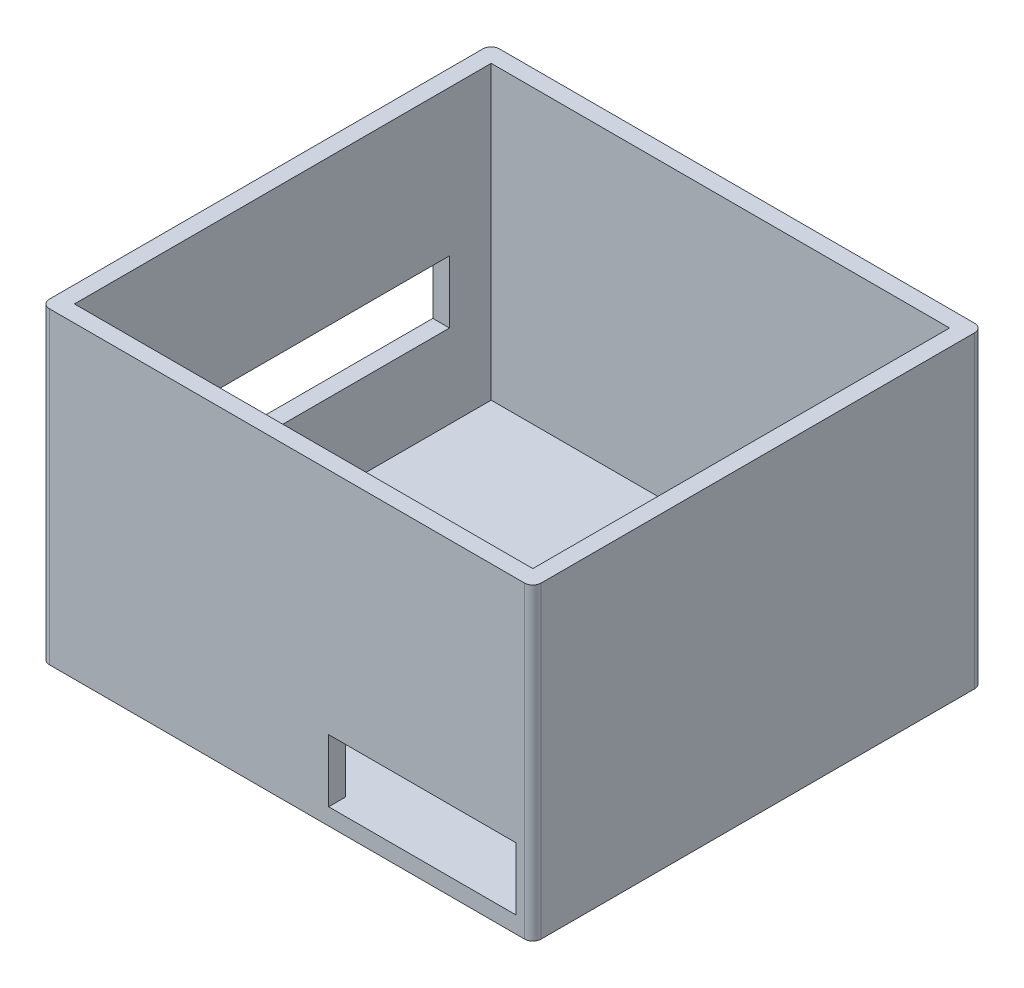
ISO-10303-21;
HEADER;
FILE_DESCRIPTION(('STEP AP214'),'2;1');
FILE_NAME('part.step','',(''),(''),'','','');
FILE_SCHEMA(('AUTOMOTIVE_DESIGN { 1 0 10303 214 1 1 1 1 }'));
ENDSEC;
DATA;
#1=APPLICATION_CONTEXT('core data for automotive mechanical design processes');
#2=APPLICATION_PROTOCOL_DEFINITION('international standard','automotive_design',2000,#1);
#3=PRODUCT_CONTEXT('',#1,'mechanical');
#4=PRODUCT('Part','Part','',(#3));
#5=PRODUCT_RELATED_PRODUCT_CATEGORY('part','',(#4));
#6=PRODUCT_DEFINITION_FORMATION('','',#4);
#7=PRODUCT_DEFINITION_CONTEXT('part definition',#1,'design');
#8=PRODUCT_DEFINITION('design','',#6,#7);
#9=PRODUCT_DEFINITION_SHAPE('','',#8);
#10=(LENGTH_UNIT() NAMED_UNIT(*) SI_UNIT(.MILLI.,.METRE.));
#11=(NAMED_UNIT(*) PLANE_ANGLE_UNIT() SI_UNIT($,.RADIAN.));
#12=(NAMED_UNIT(*) SI_UNIT($,.STERADIAN.) SOLID_ANGLE_UNIT());
#13=UNCERTAINTY_MEASURE_WITH_UNIT(LENGTH_MEASURE(1.E-05),#10,'distance_accuracy_value','');
#14=(GEOMETRIC_REPRESENTATION_CONTEXT(3) GLOBAL_UNCERTAINTY_ASSIGNED_CONTEXT((#13)) GLOBAL_UNIT_ASSIGNED_CONTEXT((#10,
#11,#12)) REPRESENTATION_CONTEXT('',''));
#15=CARTESIAN_POINT('',(0.,0.,0.));
#16=DIRECTION('',(0.,0.,1.));
#17=DIRECTION('',(1.,0.,0.));
#18=AXIS2_PLACEMENT_3D('',#15,#16,#17);
#19=CARTESIAN_POINT('',(0.,4.,0.));
#20=DIRECTION('',(1.,0.,0.));
#21=DIRECTION('',(0.,0.,-1.));
#22=AXIS2_PLACEMENT_3D('',#19,#20,#21);
#23=PLANE('',#22);
#24=DIRECTION('',(0.,-1.,0.));
#25=VECTOR('',#24,1.);
#26=CARTESIAN_POINT('',(0.,39.,-94.));
#27=LINE('',#26,#25);
#28=CARTESIAN_POINT('',(0.,39.,-94.));
#29=VERTEX_POINT('',#28);
#30=CARTESIAN_POINT('',(0.,24.,-94.));
#31=VERTEX_POINT('',#30);
#32=EDGE_CURVE('E204',#29,#31,#27,.T.);
#33=ORIENTED_EDGE('',*,*,#32,.F.);
#34=DIRECTION('',(0.,0.,-1.));
#35=VECTOR('',#34,1.);
#36=CARTESIAN_POINT('',(0.,39.,-94.));
#37=LINE('',#36,#35);
#38=CARTESIAN_POINT('',(0.,39.,-14.));
#39=VERTEX_POINT('',#38);
#40=EDGE_CURVE('E207',#39,#29,#37,.T.);
#41=ORIENTED_EDGE('',*,*,#40,.F.);
#42=DIRECTION('',(0.,1.,0.));
#43=VECTOR('',#42,1.);
#44=CARTESIAN_POINT('',(0.,39.,-14.));
#45=LINE('',#44,#43);
#46=CARTESIAN_POINT('',(0.,24.,-14.));
#47=VERTEX_POINT('',#46);
#48=EDGE_CURVE('E200',#47,#39,#45,.T.);
#49=ORIENTED_EDGE('',*,*,#48,.F.);
#50=DIRECTION('',(0.,0.,1.));
#51=VECTOR('',#50,1.);
#52=CARTESIAN_POINT('',(0.,24.,-94.));
#53=LINE('',#52,#51);
#54=EDGE_CURVE('E201',#31,#47,#53,.T.);
#55=ORIENTED_EDGE('',*,*,#54,.F.);
#56=EDGE_LOOP('',(#33,#41,#49,#55));
#57=FACE_BOUND('',#56,.T.);
#58=DIRECTION('',(0.,0.,1.));
#59=VECTOR('',#58,1.);
#60=CARTESIAN_POINT('',(0.,74.,-108.));
#61=LINE('',#60,#59);
#62=CARTESIAN_POINT('',(0.,74.,-106.));
#63=VERTEX_POINT('',#62);
#64=CARTESIAN_POINT('',(0.,74.,-2.));
#65=VERTEX_POINT('',#64);
#66=EDGE_CURVE('E259',#63,#65,#61,.T.);
#67=ORIENTED_EDGE('',*,*,#66,.F.);
#68=DIRECTION('',(0.,-1.,0.));
#69=VECTOR('',#68,1.);
#70=CARTESIAN_POINT('',(0.,4.,-106.));
#71=LINE('',#70,#69);
#72=CARTESIAN_POINT('',(0.,0.,-106.));
#73=VERTEX_POINT('',#72);
#74=EDGE_CURVE('E11',#63,#73,#71,.T.);
#75=ORIENTED_EDGE('',*,*,#74,.T.);
#76=DIRECTION('',(0.,0.,1.));
#77=VECTOR('',#76,1.);
#78=CARTESIAN_POINT('',(0.,0.,0.));
#79=LINE('',#78,#77);
#80=CARTESIAN_POINT('',(0.,0.,-2.));
#81=VERTEX_POINT('',#80);
#82=EDGE_CURVE('E269',#73,#81,#79,.T.);
#83=ORIENTED_EDGE('',*,*,#82,.T.);
#84=DIRECTION('',(0.,-1.,0.));
#85=VECTOR('',#84,1.);
#86=CARTESIAN_POINT('',(0.,4.,-2.));
#87=LINE('',#86,#85);
#88=EDGE_CURVE('E40',#81,#65,#87,.F.);
#89=ORIENTED_EDGE('',*,*,#88,.T.);
#90=EDGE_LOOP('',(#67,#75,#83,#89));
#91=FACE_BOUND('',#90,.T.);
#92=ADVANCED_FACE('F32',(#57,#91),#23,.F.);
#93=CARTESIAN_POINT('',(0.,4.,0.));
#94=DIRECTION('',(0.,0.,-1.));
#95=DIRECTION('',(-1.,0.,0.));
#96=AXIS2_PLACEMENT_3D('',#93,#94,#95);
#97=PLANE('',#96);
#98=DIRECTION('',(0.,-1.,0.));
#99=VECTOR('',#98,1.);
#100=CARTESIAN_POINT('',(69.,19.,0.));
#101=LINE('',#100,#99);
#102=CARTESIAN_POINT('',(69.,19.,0.));
#103=VERTEX_POINT('',#102);
#104=CARTESIAN_POINT('',(69.,4.,0.));
#105=VERTEX_POINT('',#104);
#106=EDGE_CURVE('E191',#103,#105,#101,.T.);
#107=ORIENTED_EDGE('',*,*,#106,.F.);
#108=DIRECTION('',(-1.,0.,0.));
#109=VECTOR('',#108,1.);
#110=CARTESIAN_POINT('',(69.,19.,0.));
#111=LINE('',#110,#109);
#112=CARTESIAN_POINT('',(114.,19.,0.));
#113=VERTEX_POINT('',#112);
#114=EDGE_CURVE('E181',#113,#103,#111,.T.);
#115=ORIENTED_EDGE('',*,*,#114,.F.);
#116=DIRECTION('',(0.,1.,0.));
#117=VECTOR('',#116,1.);
#118=CARTESIAN_POINT('',(114.,19.,0.));
#119=LINE('',#118,#117);
#120=CARTESIAN_POINT('',(114.,4.,0.));
#121=VERTEX_POINT('',#120);
#122=EDGE_CURVE('E194',#121,#113,#119,.T.);
#123=ORIENTED_EDGE('',*,*,#122,.F.);
#124=DIRECTION('',(1.,0.,0.));
#125=VECTOR('',#124,1.);
#126=CARTESIAN_POINT('',(69.,4.,0.));
#127=LINE('',#126,#125);
#128=EDGE_CURVE('E188',#105,#121,#127,.T.);
#129=ORIENTED_EDGE('',*,*,#128,.F.);
#130=EDGE_LOOP('',(#107,#115,#123,#129));
#131=FACE_BOUND('',#130,.T.);
#132=DIRECTION('',(1.,0.,0.));
#133=VECTOR('',#132,1.);
#134=CARTESIAN_POINT('',(0.,0.,0.));
#135=LINE('',#134,#133);
#136=CARTESIAN_POINT('',(2.,0.,0.));
#137=VERTEX_POINT('',#136);
#138=CARTESIAN_POINT('',(116.,0.,0.));
#139=VERTEX_POINT('',#138);
#140=EDGE_CURVE('E272',#137,#139,#135,.T.);
#141=ORIENTED_EDGE('',*,*,#140,.T.);
#142=DIRECTION('',(0.,-1.,0.));
#143=VECTOR('',#142,1.);
#144=CARTESIAN_POINT('',(116.,4.,0.));
#145=LINE('',#144,#143);
#146=CARTESIAN_POINT('',(116.,74.,0.));
#147=VERTEX_POINT('',#146);
#148=EDGE_CURVE('E296',#139,#147,#145,.F.);
#149=ORIENTED_EDGE('',*,*,#148,.T.);
#150=DIRECTION('',(1.,0.,0.));
#151=VECTOR('',#150,1.);
#152=CARTESIAN_POINT('',(0.,74.,0.));
#153=LINE('',#152,#151);
#154=CARTESIAN_POINT('',(2.,74.,0.));
#155=VERTEX_POINT('',#154);
#156=EDGE_CURVE('E262',#155,#147,#153,.T.);
#157=ORIENTED_EDGE('',*,*,#156,.F.);
#158=DIRECTION('',(0.,-1.,0.));
#159=VECTOR('',#158,1.);
#160=CARTESIAN_POINT('',(2.,4.,0.));
#161=LINE('',#160,#159);
#162=EDGE_CURVE('E293',#155,#137,#161,.T.);
#163=ORIENTED_EDGE('',*,*,#162,.T.);
#164=EDGE_LOOP('',(#141,#149,#157,#163));
#165=FACE_BOUND('',#164,.T.);
#166=ADVANCED_FACE('F322',(#131,#165),#97,.F.);
#167=CARTESIAN_POINT('',(118.,4.,0.));
#168=DIRECTION('',(-1.,0.,0.));
#169=DIRECTION('',(0.,0.,1.));
#170=AXIS2_PLACEMENT_3D('',#167,#168,#169);
#171=PLANE('',#170);
#172=DIRECTION('',(0.,0.,-1.));
#173=VECTOR('',#172,1.);
#174=CARTESIAN_POINT('',(118.,74.,-108.));
#175=LINE('',#174,#173);
#176=CARTESIAN_POINT('',(118.,74.,-2.));
#177=VERTEX_POINT('',#176);
#178=CARTESIAN_POINT('',(118.,74.,-106.));
#179=VERTEX_POINT('',#178);
#180=EDGE_CURVE('E265',#177,#179,#175,.T.);
#181=ORIENTED_EDGE('',*,*,#180,.F.);
#182=DIRECTION('',(0.,-1.,0.));
#183=VECTOR('',#182,1.);
#184=CARTESIAN_POINT('',(118.,4.,-2.));
#185=LINE('',#184,#183);
#186=CARTESIAN_POINT('',(118.,0.,-2.));
#187=VERTEX_POINT('',#186);
#188=EDGE_CURVE('E282',#177,#187,#185,.T.);
#189=ORIENTED_EDGE('',*,*,#188,.T.);
#190=DIRECTION('',(0.,0.,-1.));
#191=VECTOR('',#190,1.);
#192=CARTESIAN_POINT('',(118.,0.,0.));
#193=LINE('',#192,#191);
#194=CARTESIAN_POINT('',(118.,0.,-106.));
#195=VERTEX_POINT('',#194);
#196=EDGE_CURVE('E275',#187,#195,#193,.T.);
#197=ORIENTED_EDGE('',*,*,#196,.T.);
#198=DIRECTION('',(0.,-1.,0.));
#199=VECTOR('',#198,1.);
#200=CARTESIAN_POINT('',(118.,4.,-106.));
#201=LINE('',#200,#199);
#202=EDGE_CURVE('E280',#195,#179,#201,.F.);
#203=ORIENTED_EDGE('',*,*,#202,.T.);
#204=EDGE_LOOP('',(#181,#189,#197,#203));
#205=FACE_BOUND('',#204,.T.);
#206=ADVANCED_FACE('F333',(#205),#171,.F.);
#207=CARTESIAN_POINT('',(0.,4.,-108.));
#208=DIRECTION('',(0.,0.,1.));
#209=DIRECTION('',(1.,0.,0.));
#210=AXIS2_PLACEMENT_3D('',#207,#208,#209);
#211=PLANE('',#210);
#212=DIRECTION('',(-1.,0.,0.));
#213=VECTOR('',#212,1.);
#214=CARTESIAN_POINT('',(0.,74.,-108.));
#215=LINE('',#214,#213);
#216=CARTESIAN_POINT('',(116.,74.,-108.));
#217=VERTEX_POINT('',#216);
#218=CARTESIAN_POINT('',(2.,74.,-108.));
#219=VERTEX_POINT('',#218);
#220=EDGE_CURVE('E267',#217,#219,#215,.T.);
#221=ORIENTED_EDGE('',*,*,#220,.F.);
#222=DIRECTION('',(0.,-1.,0.));
#223=VECTOR('',#222,1.);
#224=CARTESIAN_POINT('',(116.,4.,-108.));
#225=LINE('',#224,#223);
#226=CARTESIAN_POINT('',(116.,0.,-108.));
#227=VERTEX_POINT('',#226);
#228=EDGE_CURVE('E306',#217,#227,#225,.T.);
#229=ORIENTED_EDGE('',*,*,#228,.T.);
#230=DIRECTION('',(-1.,0.,0.));
#231=VECTOR('',#230,1.);
#232=CARTESIAN_POINT('',(0.,0.,-108.));
#233=LINE('',#232,#231);
#234=CARTESIAN_POINT('',(2.,0.,-108.));
#235=VERTEX_POINT('',#234);
#236=EDGE_CURVE('E278',#227,#235,#233,.T.);
#237=ORIENTED_EDGE('',*,*,#236,.T.);
#238=DIRECTION('',(0.,-1.,0.));
#239=VECTOR('',#238,1.);
#240=CARTESIAN_POINT('',(2.,4.,-108.));
#241=LINE('',#240,#239);
#242=EDGE_CURVE('E47',#235,#219,#241,.F.);
#243=ORIENTED_EDGE('',*,*,#242,.T.);
#244=EDGE_LOOP('',(#221,#229,#237,#243));
#245=FACE_BOUND('',#244,.T.);
#246=ADVANCED_FACE('F339',(#245),#211,.F.);
#247=CARTESIAN_POINT('',(0.,0.,0.));
#248=DIRECTION('',(0.,-1.,0.));
#249=DIRECTION('',(0.,0.,-1.));
#250=AXIS2_PLACEMENT_3D('',#247,#248,#249);
#251=PLANE('',#250);
#252=ORIENTED_EDGE('',*,*,#196,.F.);
#253=CARTESIAN_POINT('',(116.,0.,-2.));
#254=DIRECTION('',(0.,-1.,0.));
#255=DIRECTION('',(0.,0.,-1.));
#256=AXIS2_PLACEMENT_3D('',#253,#254,#255);
#257=CIRCLE('',#256,2.);
#258=EDGE_CURVE('E291',#187,#139,#257,.T.);
#259=ORIENTED_EDGE('',*,*,#258,.T.);
#260=ORIENTED_EDGE('',*,*,#140,.F.);
#261=CARTESIAN_POINT('',(2.,0.,-2.));
#262=DIRECTION('',(0.,-1.,0.));
#263=DIRECTION('',(0.,0.,-1.));
#264=AXIS2_PLACEMENT_3D('',#261,#262,#263);
#265=CIRCLE('',#264,2.);
#266=EDGE_CURVE('E285',#137,#81,#265,.T.);
#267=ORIENTED_EDGE('',*,*,#266,.T.);
#268=ORIENTED_EDGE('',*,*,#82,.F.);
#269=CARTESIAN_POINT('',(2.,0.,-106.));
#270=DIRECTION('',(0.,-1.,0.));
#271=DIRECTION('',(0.,0.,-1.));
#272=AXIS2_PLACEMENT_3D('',#269,#270,#271);
#273=CIRCLE('',#272,2.);
#274=EDGE_CURVE('E287',#73,#235,#273,.T.);
#275=ORIENTED_EDGE('',*,*,#274,.T.);
#276=ORIENTED_EDGE('',*,*,#236,.F.);
#277=CARTESIAN_POINT('',(116.,0.,-106.));
#278=DIRECTION('',(0.,-1.,0.));
#279=DIRECTION('',(0.,0.,-1.));
#280=AXIS2_PLACEMENT_3D('',#277,#278,#279);
#281=CIRCLE('',#280,2.);
#282=EDGE_CURVE('E289',#227,#195,#281,.T.);
#283=ORIENTED_EDGE('',*,*,#282,.T.);
#284=EDGE_LOOP('',(#252,#259,#260,#267,#268,#275,#276,#283));
#285=FACE_BOUND('',#284,.T.);
#286=ADVANCED_FACE('F326',(#285),#251,.T.);
#287=CARTESIAN_POINT('',(0.,74.,0.));
#288=DIRECTION('',(0.,1.,0.));
#289=DIRECTION('',(0.,0.,1.));
#290=AXIS2_PLACEMENT_3D('',#287,#288,#289);
#291=PLANE('',#290);
#292=ORIENTED_EDGE('',*,*,#156,.T.);
#293=CARTESIAN_POINT('',(116.,74.,-2.));
#294=DIRECTION('',(0.,1.,0.));
#295=DIRECTION('',(0.,0.,1.));
#296=AXIS2_PLACEMENT_3D('',#293,#294,#295);
#297=CIRCLE('',#296,2.);
#298=EDGE_CURVE('E303',#147,#177,#297,.T.);
#299=ORIENTED_EDGE('',*,*,#298,.T.);
#300=ORIENTED_EDGE('',*,*,#180,.T.);
#301=CARTESIAN_POINT('',(116.,74.,-106.));
#302=DIRECTION('',(0.,1.,0.));
#303=DIRECTION('',(0.,0.,1.));
#304=AXIS2_PLACEMENT_3D('',#301,#302,#303);
#305=CIRCLE('',#304,2.);
#306=EDGE_CURVE('E54',#179,#217,#305,.T.);
#307=ORIENTED_EDGE('',*,*,#306,.T.);
#308=ORIENTED_EDGE('',*,*,#220,.T.);
#309=CARTESIAN_POINT('',(2.,74.,-106.));
#310=DIRECTION('',(0.,1.,0.));
#311=DIRECTION('',(0.,0.,1.));
#312=AXIS2_PLACEMENT_3D('',#309,#310,#311);
#313=CIRCLE('',#312,2.);
#314=EDGE_CURVE('E300',#219,#63,#313,.T.);
#315=ORIENTED_EDGE('',*,*,#314,.T.);
#316=ORIENTED_EDGE('',*,*,#66,.T.);
#317=CARTESIAN_POINT('',(2.,74.,-2.));
#318=DIRECTION('',(0.,1.,0.));
#319=DIRECTION('',(0.,0.,1.));
#320=AXIS2_PLACEMENT_3D('',#317,#318,#319);
#321=CIRCLE('',#320,2.);
#322=EDGE_CURVE('E298',#65,#155,#321,.T.);
#323=ORIENTED_EDGE('',*,*,#322,.T.);
#324=EDGE_LOOP('',(#292,#299,#300,#307,#308,#315,#316,#323));
#325=FACE_BOUND('',#324,.T.);
#326=DIRECTION('',(0.,0.,1.));
#327=VECTOR('',#326,1.);
#328=CARTESIAN_POINT('',(4.,74.,-104.));
#329=LINE('',#328,#327);
#330=CARTESIAN_POINT('',(4.,74.,-104.));
#331=VERTEX_POINT('',#330);
#332=CARTESIAN_POINT('',(4.,74.,-4.));
#333=VERTEX_POINT('',#332);
#334=EDGE_CURVE('E235',#331,#333,#329,.T.);
#335=ORIENTED_EDGE('',*,*,#334,.F.);
#336=DIRECTION('',(-1.,0.,0.));
#337=VECTOR('',#336,1.);
#338=CARTESIAN_POINT('',(4.,74.,-104.));
#339=LINE('',#338,#337);
#340=CARTESIAN_POINT('',(114.,74.,-104.));
#341=VERTEX_POINT('',#340);
#342=EDGE_CURVE('E233',#341,#331,#339,.T.);
#343=ORIENTED_EDGE('',*,*,#342,.F.);
#344=DIRECTION('',(0.,0.,-1.));
#345=VECTOR('',#344,1.);
#346=CARTESIAN_POINT('',(114.,74.,-104.));
#347=LINE('',#346,#345);
#348=CARTESIAN_POINT('',(114.,74.,-4.));
#349=VERTEX_POINT('',#348);
#350=EDGE_CURVE('E240',#349,#341,#347,.T.);
#351=ORIENTED_EDGE('',*,*,#350,.F.);
#352=DIRECTION('',(1.,0.,0.));
#353=VECTOR('',#352,1.);
#354=CARTESIAN_POINT('',(4.,74.,-4.));
#355=LINE('',#354,#353);
#356=EDGE_CURVE('E238',#333,#349,#355,.T.);
#357=ORIENTED_EDGE('',*,*,#356,.F.);
#358=EDGE_LOOP('',(#335,#343,#351,#357));
#359=FACE_BOUND('',#358,.T.);
#360=ADVANCED_FACE('F315',(#325,#359),#291,.T.);
#361=CARTESIAN_POINT('',(4.,74.,-104.));
#362=DIRECTION('',(0.,0.,1.));
#363=DIRECTION('',(1.,0.,0.));
#364=AXIS2_PLACEMENT_3D('',#361,#362,#363);
#365=PLANE('',#364);
#366=DIRECTION('',(-1.,0.,0.));
#367=VECTOR('',#366,1.);
#368=CARTESIAN_POINT('',(4.,4.,-104.));
#369=LINE('',#368,#367);
#370=CARTESIAN_POINT('',(114.,4.,-104.));
#371=VERTEX_POINT('',#370);
#372=CARTESIAN_POINT('',(4.,4.,-104.));
#373=VERTEX_POINT('',#372);
#374=EDGE_CURVE('E232',#371,#373,#369,.T.);
#375=ORIENTED_EDGE('',*,*,#374,.F.);
#376=DIRECTION('',(0.,-1.,0.));
#377=VECTOR('',#376,1.);
#378=CARTESIAN_POINT('',(114.,74.,-104.));
#379=LINE('',#378,#377);
#380=EDGE_CURVE('E242',#341,#371,#379,.T.);
#381=ORIENTED_EDGE('',*,*,#380,.F.);
#382=ORIENTED_EDGE('',*,*,#342,.T.);
#383=DIRECTION('',(0.,-1.,0.));
#384=VECTOR('',#383,1.);
#385=CARTESIAN_POINT('',(4.,74.,-104.));
#386=LINE('',#385,#384);
#387=EDGE_CURVE('E256',#331,#373,#386,.T.);
#388=ORIENTED_EDGE('',*,*,#387,.T.);
#389=EDGE_LOOP('',(#375,#381,#382,#388));
#390=FACE_BOUND('',#389,.T.);
#391=ADVANCED_FACE('F395',(#390),#365,.T.);
#392=CARTESIAN_POINT('',(4.,74.,-104.));
#393=DIRECTION('',(1.,0.,0.));
#394=DIRECTION('',(0.,0.,-1.));
#395=AXIS2_PLACEMENT_3D('',#392,#393,#394);
#396=PLANE('',#395);
#397=DIRECTION('',(0.,0.,-1.));
#398=VECTOR('',#397,1.);
#399=CARTESIAN_POINT('',(4.,39.,-94.));
#400=LINE('',#399,#398);
#401=CARTESIAN_POINT('',(4.,39.,-14.));
#402=VERTEX_POINT('',#401);
#403=CARTESIAN_POINT('',(4.,39.,-94.));
#404=VERTEX_POINT('',#403);
#405=EDGE_CURVE('E203',#402,#404,#400,.T.);
#406=ORIENTED_EDGE('',*,*,#405,.T.);
#407=DIRECTION('',(0.,-1.,0.));
#408=VECTOR('',#407,1.);
#409=CARTESIAN_POINT('',(4.,39.,-94.));
#410=LINE('',#409,#408);
#411=CARTESIAN_POINT('',(4.,24.,-94.));
#412=VERTEX_POINT('',#411);
#413=EDGE_CURVE('E224',#404,#412,#410,.T.);
#414=ORIENTED_EDGE('',*,*,#413,.T.);
#415=DIRECTION('',(0.,0.,1.));
#416=VECTOR('',#415,1.);
#417=CARTESIAN_POINT('',(4.,24.,-94.));
#418=LINE('',#417,#416);
#419=CARTESIAN_POINT('',(4.,24.,-14.));
#420=VERTEX_POINT('',#419);
#421=EDGE_CURVE('E220',#412,#420,#418,.T.);
#422=ORIENTED_EDGE('',*,*,#421,.T.);
#423=DIRECTION('',(0.,1.,0.));
#424=VECTOR('',#423,1.);
#425=CARTESIAN_POINT('',(4.,39.,-14.));
#426=LINE('',#425,#424);
#427=EDGE_CURVE('E215',#420,#402,#426,.T.);
#428=ORIENTED_EDGE('',*,*,#427,.T.);
#429=EDGE_LOOP('',(#406,#414,#422,#428));
#430=FACE_BOUND('',#429,.T.);
#431=DIRECTION('',(0.,0.,1.));
#432=VECTOR('',#431,1.);
#433=CARTESIAN_POINT('',(4.,4.,-104.));
#434=LINE('',#433,#432);
#435=CARTESIAN_POINT('',(4.,4.,-4.));
#436=VERTEX_POINT('',#435);
#437=EDGE_CURVE('E245',#373,#436,#434,.T.);
#438=ORIENTED_EDGE('',*,*,#437,.F.);
#439=ORIENTED_EDGE('',*,*,#387,.F.);
#440=ORIENTED_EDGE('',*,*,#334,.T.);
#441=DIRECTION('',(0.,-1.,0.));
#442=VECTOR('',#441,1.);
#443=CARTESIAN_POINT('',(4.,74.,-4.));
#444=LINE('',#443,#442);
#445=EDGE_CURVE('E254',#333,#436,#444,.T.);
#446=ORIENTED_EDGE('',*,*,#445,.T.);
#447=EDGE_LOOP('',(#438,#439,#440,#446));
#448=FACE_BOUND('',#447,.T.);
#449=ADVANCED_FACE('F392',(#430,#448),#396,.T.);
#450=CARTESIAN_POINT('',(4.,74.,-4.));
#451=DIRECTION('',(0.,0.,-1.));
#452=DIRECTION('',(-1.,0.,0.));
#453=AXIS2_PLACEMENT_3D('',#450,#451,#452);
#454=PLANE('',#453);
#455=DIRECTION('',(-1.,0.,0.));
#456=VECTOR('',#455,1.);
#457=CARTESIAN_POINT('',(69.,19.,-4.));
#458=LINE('',#457,#456);
#459=CARTESIAN_POINT('',(114.,19.,-4.00000000000001));
#460=VERTEX_POINT('',#459);
#461=CARTESIAN_POINT('',(69.,19.,-4.));
#462=VERTEX_POINT('',#461);
#463=EDGE_CURVE('E178',#460,#462,#458,.T.);
#464=ORIENTED_EDGE('',*,*,#463,.T.);
#465=DIRECTION('',(0.,-1.,0.));
#466=VECTOR('',#465,1.);
#467=CARTESIAN_POINT('',(69.,19.,-4.));
#468=LINE('',#467,#466);
#469=CARTESIAN_POINT('',(69.,4.,-4.));
#470=VERTEX_POINT('',#469);
#471=EDGE_CURVE('E164',#462,#470,#468,.T.);
#472=ORIENTED_EDGE('',*,*,#471,.T.);
#473=DIRECTION('',(1.,0.,0.));
#474=VECTOR('',#473,1.);
#475=CARTESIAN_POINT('',(4.,4.,-4.));
#476=LINE('',#475,#474);
#477=EDGE_CURVE('E248',#436,#470,#476,.T.);
#478=ORIENTED_EDGE('',*,*,#477,.F.);
#479=ORIENTED_EDGE('',*,*,#445,.F.);
#480=ORIENTED_EDGE('',*,*,#356,.T.);
#481=DIRECTION('',(0.,-1.,0.));
#482=VECTOR('',#481,1.);
#483=CARTESIAN_POINT('',(114.,74.,-4.));
#484=LINE('',#483,#482);
#485=EDGE_CURVE('E187',#349,#460,#484,.T.);
#486=ORIENTED_EDGE('',*,*,#485,.T.);
#487=EDGE_LOOP('',(#464,#472,#478,#479,#480,#486));
#488=FACE_BOUND('',#487,.T.);
#489=ADVANCED_FACE('F185',(#488),#454,.T.);
#490=CARTESIAN_POINT('',(114.,74.,-104.));
#491=DIRECTION('',(-1.,0.,0.));
#492=DIRECTION('',(0.,0.,1.));
#493=AXIS2_PLACEMENT_3D('',#490,#491,#492);
#494=PLANE('',#493);
#495=DIRECTION('',(0.,0.,-1.));
#496=VECTOR('',#495,1.);
#497=CARTESIAN_POINT('',(114.,4.,-104.));
#498=LINE('',#497,#496);
#499=EDGE_CURVE('E236',#121,#371,#498,.T.);
#500=ORIENTED_EDGE('',*,*,#499,.F.);
#501=ORIENTED_EDGE('',*,*,#122,.T.);
#502=DIRECTION('',(0.,0.,1.));
#503=VECTOR('',#502,1.);
#504=CARTESIAN_POINT('',(114.,19.,-51.4341649025257));
#505=LINE('',#504,#503);
#506=EDGE_CURVE('E197',#460,#113,#505,.T.);
#507=ORIENTED_EDGE('',*,*,#506,.F.);
#508=ORIENTED_EDGE('',*,*,#485,.F.);
#509=ORIENTED_EDGE('',*,*,#350,.T.);
#510=ORIENTED_EDGE('',*,*,#380,.T.);
#511=EDGE_LOOP('',(#500,#501,#507,#508,#509,#510));
#512=FACE_BOUND('',#511,.T.);
#513=ADVANCED_FACE('F386',(#512),#494,.T.);
#514=CARTESIAN_POINT('',(0.,4.,0.));
#515=DIRECTION('',(0.,-1.,0.));
#516=DIRECTION('',(0.,0.,-1.));
#517=AXIS2_PLACEMENT_3D('',#514,#515,#516);
#518=PLANE('',#517);
#519=ORIENTED_EDGE('',*,*,#499,.T.);
#520=ORIENTED_EDGE('',*,*,#374,.T.);
#521=ORIENTED_EDGE('',*,*,#437,.T.);
#522=ORIENTED_EDGE('',*,*,#477,.T.);
#523=DIRECTION('',(0.,0.,1.));
#524=VECTOR('',#523,1.);
#525=CARTESIAN_POINT('',(69.,4.,-51.4341649025257));
#526=LINE('',#525,#524);
#527=EDGE_CURVE('E170',#470,#105,#526,.T.);
#528=ORIENTED_EDGE('',*,*,#527,.T.);
#529=ORIENTED_EDGE('',*,*,#128,.T.);
#530=EDGE_LOOP('',(#519,#520,#521,#522,#528,#529));
#531=FACE_BOUND('',#530,.T.);
#532=ADVANCED_FACE('F384',(#531),#518,.F.);
#533=CARTESIAN_POINT('',(85.3941029804985,39.,-94.));
#534=DIRECTION('',(0.,1.,0.));
#535=DIRECTION('',(0.,0.,1.));
#536=AXIS2_PLACEMENT_3D('',#533,#534,#535);
#537=PLANE('',#536);
#538=DIRECTION('',(-1.,0.,0.));
#539=VECTOR('',#538,1.);
#540=CARTESIAN_POINT('',(85.3941029804985,39.,-14.));
#541=LINE('',#540,#539);
#542=EDGE_CURVE('E218',#402,#39,#541,.T.);
#543=ORIENTED_EDGE('',*,*,#542,.T.);
#544=ORIENTED_EDGE('',*,*,#40,.T.);
#545=DIRECTION('',(-1.,0.,0.));
#546=VECTOR('',#545,1.);
#547=CARTESIAN_POINT('',(85.3941029804985,39.,-94.));
#548=LINE('',#547,#546);
#549=EDGE_CURVE('E214',#404,#29,#548,.T.);
#550=ORIENTED_EDGE('',*,*,#549,.F.);
#551=ORIENTED_EDGE('',*,*,#405,.F.);
#552=EDGE_LOOP('',(#543,#544,#550,#551));
#553=FACE_BOUND('',#552,.T.);
#554=ADVANCED_FACE('F380',(#553),#537,.F.);
#555=CARTESIAN_POINT('',(85.3941029804985,39.,-94.));
#556=DIRECTION('',(0.,0.,-1.));
#557=DIRECTION('',(-1.,0.,0.));
#558=AXIS2_PLACEMENT_3D('',#555,#556,#557);
#559=PLANE('',#558);
#560=ORIENTED_EDGE('',*,*,#549,.T.);
#561=ORIENTED_EDGE('',*,*,#32,.T.);
#562=DIRECTION('',(-1.,0.,0.));
#563=VECTOR('',#562,1.);
#564=CARTESIAN_POINT('',(85.3941029804985,24.,-94.));
#565=LINE('',#564,#563);
#566=EDGE_CURVE('E223',#412,#31,#565,.T.);
#567=ORIENTED_EDGE('',*,*,#566,.F.);
#568=ORIENTED_EDGE('',*,*,#413,.F.);
#569=EDGE_LOOP('',(#560,#561,#567,#568));
#570=FACE_BOUND('',#569,.T.);
#571=ADVANCED_FACE('F376',(#570),#559,.F.);
#572=CARTESIAN_POINT('',(85.3941029804985,24.,-94.));
#573=DIRECTION('',(0.,-1.,0.));
#574=DIRECTION('',(0.,0.,-1.));
#575=AXIS2_PLACEMENT_3D('',#572,#573,#574);
#576=PLANE('',#575);
#577=ORIENTED_EDGE('',*,*,#566,.T.);
#578=ORIENTED_EDGE('',*,*,#54,.T.);
#579=DIRECTION('',(-1.,0.,0.));
#580=VECTOR('',#579,1.);
#581=CARTESIAN_POINT('',(85.3941029804985,24.,-14.));
#582=LINE('',#581,#580);
#583=EDGE_CURVE('E219',#420,#47,#582,.T.);
#584=ORIENTED_EDGE('',*,*,#583,.F.);
#585=ORIENTED_EDGE('',*,*,#421,.F.);
#586=EDGE_LOOP('',(#577,#578,#584,#585));
#587=FACE_BOUND('',#586,.T.);
#588=ADVANCED_FACE('F372',(#587),#576,.F.);
#589=CARTESIAN_POINT('',(85.3941029804985,39.,-14.));
#590=DIRECTION('',(0.,0.,1.));
#591=DIRECTION('',(0.,-1.,0.));
#592=AXIS2_PLACEMENT_3D('',#589,#590,#591);
#593=PLANE('',#592);
#594=ORIENTED_EDGE('',*,*,#583,.T.);
#595=ORIENTED_EDGE('',*,*,#48,.T.);
#596=ORIENTED_EDGE('',*,*,#542,.F.);
#597=ORIENTED_EDGE('',*,*,#427,.F.);
#598=EDGE_LOOP('',(#594,#595,#596,#597));
#599=FACE_BOUND('',#598,.T.);
#600=ADVANCED_FACE('F367',(#599),#593,.F.);
#601=CARTESIAN_POINT('',(69.,19.,-51.4341649025257));
#602=DIRECTION('',(0.,1.,0.));
#603=DIRECTION('',(-1.,0.,0.));
#604=AXIS2_PLACEMENT_3D('',#601,#602,#603);
#605=PLANE('',#604);
#606=ORIENTED_EDGE('',*,*,#506,.T.);
#607=ORIENTED_EDGE('',*,*,#114,.T.);
#608=DIRECTION('',(0.,0.,1.));
#609=VECTOR('',#608,1.);
#610=CARTESIAN_POINT('',(69.,19.,-51.4341649025257));
#611=LINE('',#610,#609);
#612=EDGE_CURVE('E168',#462,#103,#611,.T.);
#613=ORIENTED_EDGE('',*,*,#612,.F.);
#614=ORIENTED_EDGE('',*,*,#463,.F.);
#615=EDGE_LOOP('',(#606,#607,#613,#614));
#616=FACE_BOUND('',#615,.T.);
#617=ADVANCED_FACE('F177',(#616),#605,.F.);
#618=CARTESIAN_POINT('',(69.,19.,-51.4341649025257));
#619=DIRECTION('',(-1.,0.,0.));
#620=DIRECTION('',(0.,0.,1.));
#621=AXIS2_PLACEMENT_3D('',#618,#619,#620);
#622=PLANE('',#621);
#623=ORIENTED_EDGE('',*,*,#612,.T.);
#624=ORIENTED_EDGE('',*,*,#106,.T.);
#625=ORIENTED_EDGE('',*,*,#527,.F.);
#626=ORIENTED_EDGE('',*,*,#471,.F.);
#627=EDGE_LOOP('',(#623,#624,#625,#626));
#628=FACE_BOUND('',#627,.T.);
#629=ADVANCED_FACE('F166',(#628),#622,.F.);
#630=CARTESIAN_POINT('',(116.,4.,-2.));
#631=DIRECTION('',(0.,-1.,0.));
#632=DIRECTION('',(0.,0.,-1.));
#633=AXIS2_PLACEMENT_3D('',#630,#631,#632);
#634=CYLINDRICAL_SURFACE('',#633,2.);
#635=ORIENTED_EDGE('',*,*,#298,.F.);
#636=ORIENTED_EDGE('',*,*,#148,.F.);
#637=ORIENTED_EDGE('',*,*,#258,.F.);
#638=ORIENTED_EDGE('',*,*,#188,.F.);
#639=EDGE_LOOP('',(#635,#636,#637,#638));
#640=FACE_BOUND('',#639,.T.);
#641=ADVANCED_FACE('F330',(#640),#634,.T.);
#642=CARTESIAN_POINT('',(116.,4.,-106.));
#643=DIRECTION('',(0.,-1.,0.));
#644=DIRECTION('',(0.,0.,-1.));
#645=AXIS2_PLACEMENT_3D('',#642,#643,#644);
#646=CYLINDRICAL_SURFACE('',#645,2.);
#647=ORIENTED_EDGE('',*,*,#306,.F.);
#648=ORIENTED_EDGE('',*,*,#202,.F.);
#649=ORIENTED_EDGE('',*,*,#282,.F.);
#650=ORIENTED_EDGE('',*,*,#228,.F.);
#651=EDGE_LOOP('',(#647,#648,#649,#650));
#652=FACE_BOUND('',#651,.T.);
#653=ADVANCED_FACE('F337',(#652),#646,.T.);
#654=CARTESIAN_POINT('',(2.,4.,-106.));
#655=DIRECTION('',(0.,-1.,0.));
#656=DIRECTION('',(0.,0.,-1.));
#657=AXIS2_PLACEMENT_3D('',#654,#655,#656);
#658=CYLINDRICAL_SURFACE('',#657,2.);
#659=ORIENTED_EDGE('',*,*,#314,.F.);
#660=ORIENTED_EDGE('',*,*,#242,.F.);
#661=ORIENTED_EDGE('',*,*,#274,.F.);
#662=ORIENTED_EDGE('',*,*,#74,.F.);
#663=EDGE_LOOP('',(#659,#660,#661,#662));
#664=FACE_BOUND('',#663,.T.);
#665=ADVANCED_FACE('F341',(#664),#658,.T.);
#666=CARTESIAN_POINT('',(2.,4.,-2.));
#667=DIRECTION('',(0.,-1.,0.));
#668=DIRECTION('',(0.,0.,-1.));
#669=AXIS2_PLACEMENT_3D('',#666,#667,#668);
#670=CYLINDRICAL_SURFACE('',#669,2.);
#671=ORIENTED_EDGE('',*,*,#322,.F.);
#672=ORIENTED_EDGE('',*,*,#88,.F.);
#673=ORIENTED_EDGE('',*,*,#266,.F.);
#674=ORIENTED_EDGE('',*,*,#162,.F.);
#675=EDGE_LOOP('',(#671,#672,#673,#674));
#676=FACE_BOUND('',#675,.T.);
#677=ADVANCED_FACE('F34',(#676),#670,.T.);
#678=CLOSED_SHELL('',(#92,#166,#206,#246,#286,#360,#391,#449,#489,#513,#532,#554,#571,#588,#600,
#617,#629,#641,#653,#665,#677));
#679=MANIFOLD_SOLID_BREP('B2',#678);
#680=ADVANCED_BREP_SHAPE_REPRESENTATION('',(#18,#679),#14);
#681=SHAPE_DEFINITION_REPRESENTATION(#9,#680);
ENDSEC;
END-ISO-10303-21;
